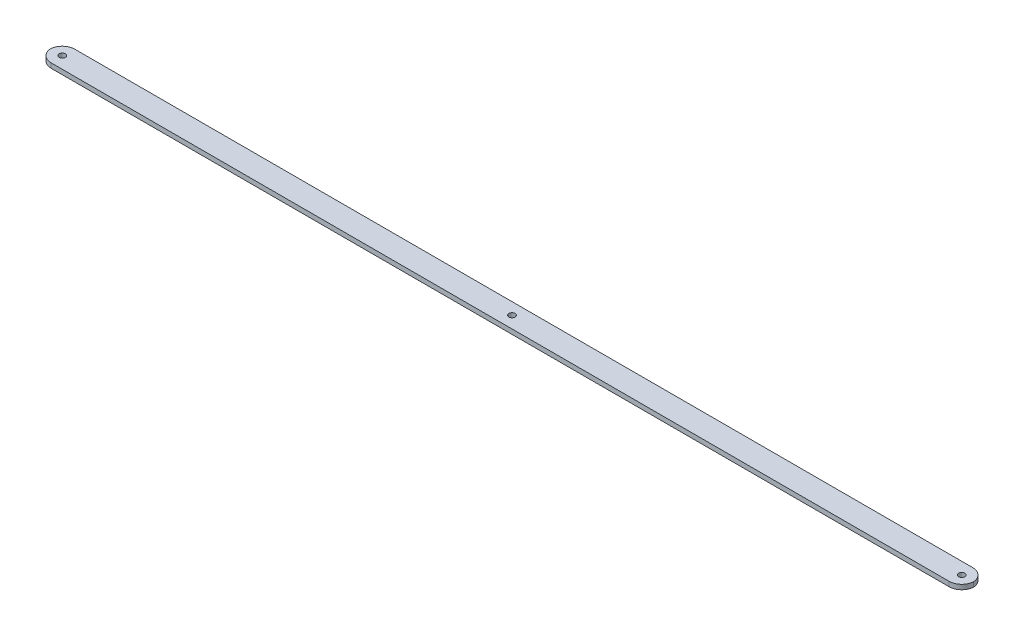
ISO-10303-21;
HEADER;
FILE_DESCRIPTION(('STEP AP214'),'2;1');
FILE_NAME('part.step','',(''),(''),'','','');
FILE_SCHEMA(('AUTOMOTIVE_DESIGN { 1 0 10303 214 1 1 1 1 }'));
ENDSEC;
DATA;
#1=APPLICATION_CONTEXT('core data for automotive mechanical design processes');
#2=APPLICATION_PROTOCOL_DEFINITION('international standard','automotive_design',2000,#1);
#3=PRODUCT_CONTEXT('',#1,'mechanical');
#4=PRODUCT('Part','Part','',(#3));
#5=PRODUCT_RELATED_PRODUCT_CATEGORY('part','',(#4));
#6=PRODUCT_DEFINITION_FORMATION('','',#4);
#7=PRODUCT_DEFINITION_CONTEXT('part definition',#1,'design');
#8=PRODUCT_DEFINITION('design','',#6,#7);
#9=PRODUCT_DEFINITION_SHAPE('','',#8);
#10=(LENGTH_UNIT() NAMED_UNIT(*) SI_UNIT(.MILLI.,.METRE.));
#11=(NAMED_UNIT(*) PLANE_ANGLE_UNIT() SI_UNIT($,.RADIAN.));
#12=(NAMED_UNIT(*) SI_UNIT($,.STERADIAN.) SOLID_ANGLE_UNIT());
#13=UNCERTAINTY_MEASURE_WITH_UNIT(LENGTH_MEASURE(1.E-05),#10,'distance_accuracy_value','');
#14=(GEOMETRIC_REPRESENTATION_CONTEXT(3) GLOBAL_UNCERTAINTY_ASSIGNED_CONTEXT((#13)) GLOBAL_UNIT_ASSIGNED_CONTEXT((#10,
#11,#12)) REPRESENTATION_CONTEXT('',''));
#15=CARTESIAN_POINT('',(0.,0.,0.));
#16=DIRECTION('',(0.,0.,1.));
#17=DIRECTION('',(1.,0.,0.));
#18=AXIS2_PLACEMENT_3D('',#15,#16,#17);
#19=CARTESIAN_POINT('',(0.,3.,7.5));
#20=DIRECTION('',(0.,0.,-1.));
#21=DIRECTION('',(-1.,0.,0.));
#22=AXIS2_PLACEMENT_3D('',#19,#20,#21);
#23=PLANE('',#22);
#24=DIRECTION('',(1.,0.,0.));
#25=VECTOR('',#24,1.);
#26=CARTESIAN_POINT('',(0.,0.,7.5));
#27=LINE('',#26,#25);
#28=CARTESIAN_POINT('',(-142.,0.,7.5));
#29=VERTEX_POINT('',#28);
#30=CARTESIAN_POINT('',(427.,0.,7.5));
#31=VERTEX_POINT('',#30);
#32=EDGE_CURVE('E110',#29,#31,#27,.T.);
#33=ORIENTED_EDGE('',*,*,#32,.T.);
#34=DIRECTION('',(0.,-1.,0.));
#35=VECTOR('',#34,1.);
#36=CARTESIAN_POINT('',(427.,3.,7.5));
#37=LINE('',#36,#35);
#38=CARTESIAN_POINT('',(427.,3.,7.5));
#39=VERTEX_POINT('',#38);
#40=EDGE_CURVE('E114',#31,#39,#37,.F.);
#41=ORIENTED_EDGE('',*,*,#40,.T.);
#42=DIRECTION('',(1.,0.,0.));
#43=VECTOR('',#42,1.);
#44=CARTESIAN_POINT('',(0.,3.,7.5));
#45=LINE('',#44,#43);
#46=CARTESIAN_POINT('',(-142.,3.,7.5));
#47=VERTEX_POINT('',#46);
#48=EDGE_CURVE('E112',#47,#39,#45,.T.);
#49=ORIENTED_EDGE('',*,*,#48,.F.);
#50=DIRECTION('',(0.,-1.,0.));
#51=VECTOR('',#50,1.);
#52=CARTESIAN_POINT('',(-142.,0.,7.5));
#53=LINE('',#52,#51);
#54=EDGE_CURVE('E98',#47,#29,#53,.T.);
#55=ORIENTED_EDGE('',*,*,#54,.T.);
#56=EDGE_LOOP('',(#33,#41,#49,#55));
#57=FACE_BOUND('',#56,.T.);
#58=ADVANCED_FACE('F39',(#57),#23,.F.);
#59=CARTESIAN_POINT('',(0.,3.,-7.5));
#60=DIRECTION('',(0.,0.,-1.));
#61=DIRECTION('',(-1.,0.,0.));
#62=AXIS2_PLACEMENT_3D('',#59,#60,#61);
#63=PLANE('',#62);
#64=DIRECTION('',(1.,0.,0.));
#65=VECTOR('',#64,1.);
#66=CARTESIAN_POINT('',(0.,3.,-7.5));
#67=LINE('',#66,#65);
#68=CARTESIAN_POINT('',(-142.,3.,-7.5));
#69=VERTEX_POINT('',#68);
#70=CARTESIAN_POINT('',(427.,3.,-7.5));
#71=VERTEX_POINT('',#70);
#72=EDGE_CURVE('E175',#69,#71,#67,.T.);
#73=ORIENTED_EDGE('',*,*,#72,.T.);
#74=DIRECTION('',(0.,-1.,0.));
#75=VECTOR('',#74,1.);
#76=CARTESIAN_POINT('',(427.,0.,-7.5));
#77=LINE('',#76,#75);
#78=CARTESIAN_POINT('',(427.,0.,-7.5));
#79=VERTEX_POINT('',#78);
#80=EDGE_CURVE('E11',#71,#79,#77,.T.);
#81=ORIENTED_EDGE('',*,*,#80,.T.);
#82=DIRECTION('',(1.,0.,0.));
#83=VECTOR('',#82,1.);
#84=CARTESIAN_POINT('',(0.,0.,-7.5));
#85=LINE('',#84,#83);
#86=CARTESIAN_POINT('',(-142.,0.,-7.5));
#87=VERTEX_POINT('',#86);
#88=EDGE_CURVE('E121',#87,#79,#85,.T.);
#89=ORIENTED_EDGE('',*,*,#88,.F.);
#90=DIRECTION('',(0.,-1.,0.));
#91=VECTOR('',#90,1.);
#92=CARTESIAN_POINT('',(-142.,3.,-7.5));
#93=LINE('',#92,#91);
#94=EDGE_CURVE('E49',#87,#69,#93,.F.);
#95=ORIENTED_EDGE('',*,*,#94,.T.);
#96=EDGE_LOOP('',(#73,#81,#89,#95));
#97=FACE_BOUND('',#96,.T.);
#98=ADVANCED_FACE('F177',(#97),#63,.T.);
#99=CARTESIAN_POINT('',(142.5,3.,0.));
#100=DIRECTION('',(0.,-1.,0.));
#101=DIRECTION('',(0.,0.,-1.));
#102=AXIS2_PLACEMENT_3D('',#99,#100,#101);
#103=CYLINDRICAL_SURFACE('',#102,2.);
#104=CARTESIAN_POINT('',(142.5,3.,0.));
#105=DIRECTION('',(0.,1.,0.));
#106=DIRECTION('',(0.,0.,1.));
#107=AXIS2_PLACEMENT_3D('',#104,#105,#106);
#108=CIRCLE('',#107,2.);
#109=CARTESIAN_POINT('',(142.5,3.,1.99999999999999));
#110=VERTEX_POINT('',#109);
#111=EDGE_CURVE('E181',#110,#110,#108,.T.);
#112=ORIENTED_EDGE('',*,*,#111,.T.);
#113=EDGE_LOOP('',(#112));
#114=FACE_BOUND('',#113,.T.);
#115=CARTESIAN_POINT('',(142.5,0.,0.));
#116=DIRECTION('',(0.,1.,0.));
#117=DIRECTION('',(0.,0.,1.));
#118=AXIS2_PLACEMENT_3D('',#115,#116,#117);
#119=CIRCLE('',#118,2.);
#120=CARTESIAN_POINT('',(142.5,0.,1.99999999999999));
#121=VERTEX_POINT('',#120);
#122=EDGE_CURVE('E127',#121,#121,#119,.T.);
#123=ORIENTED_EDGE('',*,*,#122,.F.);
#124=EDGE_LOOP('',(#123));
#125=FACE_BOUND('',#124,.T.);
#126=ADVANCED_FACE('F216',(#114,#125),#103,.F.);
#127=CARTESIAN_POINT('',(-142.5,3.,0.));
#128=DIRECTION('',(0.,-1.,0.));
#129=DIRECTION('',(0.,0.,-1.));
#130=AXIS2_PLACEMENT_3D('',#127,#128,#129);
#131=CYLINDRICAL_SURFACE('',#130,2.);
#132=CARTESIAN_POINT('',(-142.5,3.,0.));
#133=DIRECTION('',(0.,1.,0.));
#134=DIRECTION('',(0.,0.,1.));
#135=AXIS2_PLACEMENT_3D('',#132,#133,#134);
#136=CIRCLE('',#135,2.);
#137=CARTESIAN_POINT('',(-142.5,3.,1.99999999999999));
#138=VERTEX_POINT('',#137);
#139=EDGE_CURVE('E141',#138,#138,#136,.T.);
#140=ORIENTED_EDGE('',*,*,#139,.T.);
#141=EDGE_LOOP('',(#140));
#142=FACE_BOUND('',#141,.T.);
#143=CARTESIAN_POINT('',(-142.5,0.,0.));
#144=DIRECTION('',(0.,1.,0.));
#145=DIRECTION('',(0.,0.,1.));
#146=AXIS2_PLACEMENT_3D('',#143,#144,#145);
#147=CIRCLE('',#146,2.);
#148=CARTESIAN_POINT('',(-142.5,0.,1.99999999999999));
#149=VERTEX_POINT('',#148);
#150=EDGE_CURVE('E122',#149,#149,#147,.T.);
#151=ORIENTED_EDGE('',*,*,#150,.F.);
#152=EDGE_LOOP('',(#151));
#153=FACE_BOUND('',#152,.T.);
#154=ADVANCED_FACE('F197',(#142,#153),#131,.F.);
#155=CARTESIAN_POINT('',(427.5,3.,0.));
#156=DIRECTION('',(0.,-1.,0.));
#157=DIRECTION('',(0.,0.,-1.));
#158=AXIS2_PLACEMENT_3D('',#155,#156,#157);
#159=CYLINDRICAL_SURFACE('',#158,2.);
#160=CARTESIAN_POINT('',(427.5,3.,0.));
#161=DIRECTION('',(0.,1.,0.));
#162=DIRECTION('',(0.,0.,1.));
#163=AXIS2_PLACEMENT_3D('',#160,#161,#162);
#164=CIRCLE('',#163,2.);
#165=CARTESIAN_POINT('',(427.5,3.,1.99999999999999));
#166=VERTEX_POINT('',#165);
#167=EDGE_CURVE('E143',#166,#166,#164,.F.);
#168=ORIENTED_EDGE('',*,*,#167,.F.);
#169=EDGE_LOOP('',(#168));
#170=FACE_BOUND('',#169,.T.);
#171=CARTESIAN_POINT('',(427.5,0.,0.));
#172=DIRECTION('',(0.,1.,0.));
#173=DIRECTION('',(0.,0.,1.));
#174=AXIS2_PLACEMENT_3D('',#171,#172,#173);
#175=CIRCLE('',#174,2.);
#176=CARTESIAN_POINT('',(427.5,0.,1.99999999999999));
#177=VERTEX_POINT('',#176);
#178=EDGE_CURVE('E137',#177,#177,#175,.F.);
#179=ORIENTED_EDGE('',*,*,#178,.T.);
#180=EDGE_LOOP('',(#179));
#181=FACE_BOUND('',#180,.T.);
#182=ADVANCED_FACE('F194',(#170,#181),#159,.F.);
#183=CARTESIAN_POINT('',(0.,3.,0.));
#184=DIRECTION('',(0.,1.,0.));
#185=DIRECTION('',(0.,0.,1.));
#186=AXIS2_PLACEMENT_3D('',#183,#184,#185);
#187=PLANE('',#186);
#188=ORIENTED_EDGE('',*,*,#139,.F.);
#189=EDGE_LOOP('',(#188));
#190=FACE_BOUND('',#189,.T.);
#191=ORIENTED_EDGE('',*,*,#48,.T.);
#192=CARTESIAN_POINT('',(427.,3.,-0.5));
#193=DIRECTION('',(0.,1.,0.));
#194=DIRECTION('',(0.,0.,1.));
#195=AXIS2_PLACEMENT_3D('',#192,#193,#194);
#196=CIRCLE('',#195,8.);
#197=CARTESIAN_POINT('',(434.984359711336,3.,0.));
#198=VERTEX_POINT('',#197);
#199=EDGE_CURVE('E57',#39,#198,#196,.T.);
#200=ORIENTED_EDGE('',*,*,#199,.T.);
#201=CARTESIAN_POINT('',(427.,3.,0.5));
#202=DIRECTION('',(0.,1.,0.));
#203=DIRECTION('',(0.,0.,1.));
#204=AXIS2_PLACEMENT_3D('',#201,#202,#203);
#205=CIRCLE('',#204,8.);
#206=EDGE_CURVE('E156',#198,#71,#205,.T.);
#207=ORIENTED_EDGE('',*,*,#206,.T.);
#208=ORIENTED_EDGE('',*,*,#72,.F.);
#209=CARTESIAN_POINT('',(-142.,3.,0.5));
#210=DIRECTION('',(0.,1.,0.));
#211=DIRECTION('',(0.,0.,1.));
#212=AXIS2_PLACEMENT_3D('',#209,#210,#211);
#213=CIRCLE('',#212,8.);
#214=CARTESIAN_POINT('',(-149.984359711336,3.,0.));
#215=VERTEX_POINT('',#214);
#216=EDGE_CURVE('E64',#69,#215,#213,.T.);
#217=ORIENTED_EDGE('',*,*,#216,.T.);
#218=CARTESIAN_POINT('',(-142.,3.,-0.5));
#219=DIRECTION('',(0.,1.,0.));
#220=DIRECTION('',(0.,0.,1.));
#221=AXIS2_PLACEMENT_3D('',#218,#219,#220);
#222=CIRCLE('',#221,8.);
#223=EDGE_CURVE('E153',#215,#47,#222,.T.);
#224=ORIENTED_EDGE('',*,*,#223,.T.);
#225=EDGE_LOOP('',(#191,#200,#207,#208,#217,#224));
#226=FACE_BOUND('',#225,.T.);
#227=ORIENTED_EDGE('',*,*,#111,.F.);
#228=EDGE_LOOP('',(#227));
#229=FACE_BOUND('',#228,.T.);
#230=ORIENTED_EDGE('',*,*,#167,.T.);
#231=EDGE_LOOP('',(#230));
#232=FACE_BOUND('',#231,.T.);
#233=ADVANCED_FACE('F173',(#190,#226,#229,#232),#187,.T.);
#234=CARTESIAN_POINT('',(0.,0.,0.));
#235=DIRECTION('',(0.,1.,0.));
#236=DIRECTION('',(0.,0.,1.));
#237=AXIS2_PLACEMENT_3D('',#234,#235,#236);
#238=PLANE('',#237);
#239=ORIENTED_EDGE('',*,*,#150,.T.);
#240=EDGE_LOOP('',(#239));
#241=FACE_BOUND('',#240,.T.);
#242=CARTESIAN_POINT('',(427.,0.,0.5));
#243=DIRECTION('',(0.,1.,0.));
#244=DIRECTION('',(0.,0.,1.));
#245=AXIS2_PLACEMENT_3D('',#242,#243,#244);
#246=CIRCLE('',#245,8.);
#247=CARTESIAN_POINT('',(434.984359711336,0.,0.));
#248=VERTEX_POINT('',#247);
#249=EDGE_CURVE('E103',#79,#248,#246,.F.);
#250=ORIENTED_EDGE('',*,*,#249,.T.);
#251=CARTESIAN_POINT('',(427.,0.,-0.5));
#252=DIRECTION('',(0.,1.,0.));
#253=DIRECTION('',(0.,0.,1.));
#254=AXIS2_PLACEMENT_3D('',#251,#252,#253);
#255=CIRCLE('',#254,8.);
#256=EDGE_CURVE('E115',#248,#31,#255,.F.);
#257=ORIENTED_EDGE('',*,*,#256,.T.);
#258=ORIENTED_EDGE('',*,*,#32,.F.);
#259=CARTESIAN_POINT('',(-142.,0.,-0.5));
#260=DIRECTION('',(0.,1.,0.));
#261=DIRECTION('',(0.,0.,1.));
#262=AXIS2_PLACEMENT_3D('',#259,#260,#261);
#263=CIRCLE('',#262,8.);
#264=CARTESIAN_POINT('',(-149.984359711336,0.,0.));
#265=VERTEX_POINT('',#264);
#266=EDGE_CURVE('E94',#29,#265,#263,.F.);
#267=ORIENTED_EDGE('',*,*,#266,.T.);
#268=CARTESIAN_POINT('',(-142.,0.,0.5));
#269=DIRECTION('',(0.,1.,0.));
#270=DIRECTION('',(0.,0.,1.));
#271=AXIS2_PLACEMENT_3D('',#268,#269,#270);
#272=CIRCLE('',#271,8.);
#273=EDGE_CURVE('E104',#265,#87,#272,.F.);
#274=ORIENTED_EDGE('',*,*,#273,.T.);
#275=ORIENTED_EDGE('',*,*,#88,.T.);
#276=EDGE_LOOP('',(#250,#257,#258,#267,#274,#275));
#277=FACE_BOUND('',#276,.T.);
#278=ORIENTED_EDGE('',*,*,#122,.T.);
#279=EDGE_LOOP('',(#278));
#280=FACE_BOUND('',#279,.T.);
#281=ORIENTED_EDGE('',*,*,#178,.F.);
#282=EDGE_LOOP('',(#281));
#283=FACE_BOUND('',#282,.T.);
#284=ADVANCED_FACE('F117',(#241,#277,#280,#283),#238,.F.);
#285=CARTESIAN_POINT('',(427.,3.,0.5));
#286=DIRECTION('',(0.,1.,0.));
#287=DIRECTION('',(0.,0.,1.));
#288=AXIS2_PLACEMENT_3D('',#285,#286,#287);
#289=CYLINDRICAL_SURFACE('',#288,8.);
#290=ORIENTED_EDGE('',*,*,#80,.F.);
#291=ORIENTED_EDGE('',*,*,#206,.F.);
#292=DIRECTION('',(0.,1.,0.));
#293=VECTOR('',#292,1.);
#294=CARTESIAN_POINT('',(434.984359711336,1.5,0.));
#295=LINE('',#294,#293);
#296=EDGE_CURVE('E130',#248,#198,#295,.T.);
#297=ORIENTED_EDGE('',*,*,#296,.F.);
#298=ORIENTED_EDGE('',*,*,#249,.F.);
#299=EDGE_LOOP('',(#290,#291,#297,#298));
#300=FACE_BOUND('',#299,.T.);
#301=ADVANCED_FACE('F171',(#300),#289,.T.);
#302=CARTESIAN_POINT('',(427.,3.,-0.5));
#303=DIRECTION('',(0.,-1.,0.));
#304=DIRECTION('',(0.,0.,-1.));
#305=AXIS2_PLACEMENT_3D('',#302,#303,#304);
#306=CYLINDRICAL_SURFACE('',#305,8.);
#307=ORIENTED_EDGE('',*,*,#199,.F.);
#308=ORIENTED_EDGE('',*,*,#40,.F.);
#309=ORIENTED_EDGE('',*,*,#256,.F.);
#310=ORIENTED_EDGE('',*,*,#296,.T.);
#311=EDGE_LOOP('',(#307,#308,#309,#310));
#312=FACE_BOUND('',#311,.T.);
#313=ADVANCED_FACE('F167',(#312),#306,.T.);
#314=CARTESIAN_POINT('',(-142.,3.,0.5));
#315=DIRECTION('',(0.,-1.,0.));
#316=DIRECTION('',(0.,0.,-1.));
#317=AXIS2_PLACEMENT_3D('',#314,#315,#316);
#318=CYLINDRICAL_SURFACE('',#317,8.);
#319=DIRECTION('',(0.,-1.,0.));
#320=VECTOR('',#319,1.);
#321=CARTESIAN_POINT('',(-149.984359711336,1.5,0.));
#322=LINE('',#321,#320);
#323=EDGE_CURVE('E43',#215,#265,#322,.T.);
#324=ORIENTED_EDGE('',*,*,#323,.F.);
#325=ORIENTED_EDGE('',*,*,#216,.F.);
#326=ORIENTED_EDGE('',*,*,#94,.F.);
#327=ORIENTED_EDGE('',*,*,#273,.F.);
#328=EDGE_LOOP('',(#324,#325,#326,#327));
#329=FACE_BOUND('',#328,.T.);
#330=ADVANCED_FACE('F41',(#329),#318,.T.);
#331=CARTESIAN_POINT('',(-142.,3.,-0.5));
#332=DIRECTION('',(0.,1.,0.));
#333=DIRECTION('',(0.,0.,1.));
#334=AXIS2_PLACEMENT_3D('',#331,#332,#333);
#335=CYLINDRICAL_SURFACE('',#334,8.);
#336=ORIENTED_EDGE('',*,*,#223,.F.);
#337=ORIENTED_EDGE('',*,*,#323,.T.);
#338=ORIENTED_EDGE('',*,*,#266,.F.);
#339=ORIENTED_EDGE('',*,*,#54,.F.);
#340=EDGE_LOOP('',(#336,#337,#338,#339));
#341=FACE_BOUND('',#340,.T.);
#342=ADVANCED_FACE('F97',(#341),#335,.T.);
#343=CLOSED_SHELL('',(#58,#98,#126,#154,#182,#233,#284,#301,#313,#330,#342));
#344=MANIFOLD_SOLID_BREP('B2',#343);
#345=ADVANCED_BREP_SHAPE_REPRESENTATION('',(#18,#344),#14);
#346=SHAPE_DEFINITION_REPRESENTATION(#9,#345);
ENDSEC;
END-ISO-10303-21;
